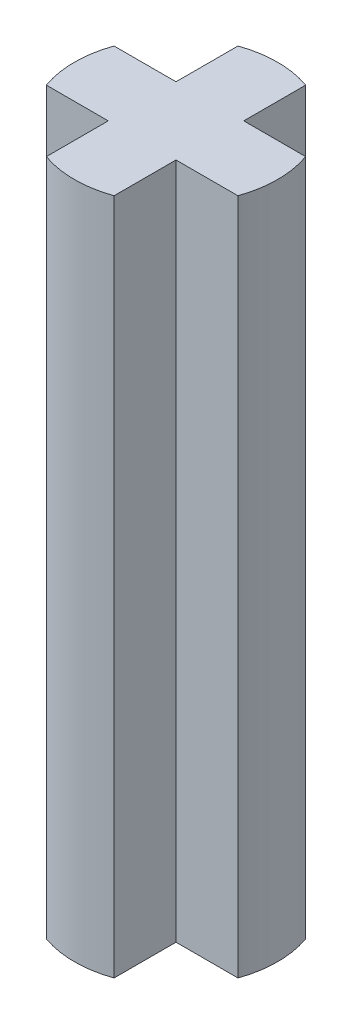
ISO-10303-21;
HEADER;
FILE_DESCRIPTION(('STEP AP214'),'2;1');
FILE_NAME('part.step','',(''),(''),'','','');
FILE_SCHEMA(('AUTOMOTIVE_DESIGN { 1 0 10303 214 1 1 1 1 }'));
ENDSEC;
DATA;
#1=APPLICATION_CONTEXT('core data for automotive mechanical design processes');
#2=APPLICATION_PROTOCOL_DEFINITION('international standard','automotive_design',2000,#1);
#3=PRODUCT_CONTEXT('',#1,'mechanical');
#4=PRODUCT('Part','Part','',(#3));
#5=PRODUCT_RELATED_PRODUCT_CATEGORY('part','',(#4));
#6=PRODUCT_DEFINITION_FORMATION('','',#4);
#7=PRODUCT_DEFINITION_CONTEXT('part definition',#1,'design');
#8=PRODUCT_DEFINITION('design','',#6,#7);
#9=PRODUCT_DEFINITION_SHAPE('','',#8);
#10=(LENGTH_UNIT() NAMED_UNIT(*) SI_UNIT(.MILLI.,.METRE.));
#11=(NAMED_UNIT(*) PLANE_ANGLE_UNIT() SI_UNIT($,.RADIAN.));
#12=(NAMED_UNIT(*) SI_UNIT($,.STERADIAN.) SOLID_ANGLE_UNIT());
#13=UNCERTAINTY_MEASURE_WITH_UNIT(LENGTH_MEASURE(1.E-05),#10,'distance_accuracy_value','');
#14=(GEOMETRIC_REPRESENTATION_CONTEXT(3) GLOBAL_UNCERTAINTY_ASSIGNED_CONTEXT((#13)) GLOBAL_UNIT_ASSIGNED_CONTEXT((#10,
#11,#12)) REPRESENTATION_CONTEXT('',''));
#15=CARTESIAN_POINT('',(0.,0.,0.));
#16=DIRECTION('',(0.,0.,1.));
#17=DIRECTION('',(1.,0.,0.));
#18=AXIS2_PLACEMENT_3D('',#15,#16,#17);
#19=CARTESIAN_POINT('',(-1.5,10.,0.5));
#20=DIRECTION('',(0.,0.,-1.));
#21=DIRECTION('',(-1.,0.,0.));
#22=AXIS2_PLACEMENT_3D('',#19,#20,#21);
#23=PLANE('',#22);
#24=DIRECTION('',(0.,1.,0.));
#25=VECTOR('',#24,1.);
#26=CARTESIAN_POINT('',(-1.4142135623731,-0.000999999999999265,0.5));
#27=LINE('',#26,#25);
#28=CARTESIAN_POINT('',(-1.4142135623731,10.,0.5));
#29=VERTEX_POINT('',#28);
#30=CARTESIAN_POINT('',(-1.4142135623731,0.,0.5));
#31=VERTEX_POINT('',#30);
#32=EDGE_CURVE('E243',#29,#31,#27,.F.);
#33=ORIENTED_EDGE('',*,*,#32,.T.);
#34=DIRECTION('',(1.,0.,0.));
#35=VECTOR('',#34,1.);
#36=CARTESIAN_POINT('',(-1.5,0.,0.5));
#37=LINE('',#36,#35);
#38=CARTESIAN_POINT('',(-0.5,0.,0.5));
#39=VERTEX_POINT('',#38);
#40=EDGE_CURVE('E211',#31,#39,#37,.T.);
#41=ORIENTED_EDGE('',*,*,#40,.T.);
#42=DIRECTION('',(0.,1.,0.));
#43=VECTOR('',#42,1.);
#44=CARTESIAN_POINT('',(-0.5,10.,0.5));
#45=LINE('',#44,#43);
#46=CARTESIAN_POINT('',(-0.5,10.,0.5));
#47=VERTEX_POINT('',#46);
#48=EDGE_CURVE('E65',#39,#47,#45,.T.);
#49=ORIENTED_EDGE('',*,*,#48,.T.);
#50=DIRECTION('',(1.,0.,0.));
#51=VECTOR('',#50,1.);
#52=CARTESIAN_POINT('',(-1.5,10.,0.5));
#53=LINE('',#52,#51);
#54=EDGE_CURVE('E206',#29,#47,#53,.T.);
#55=ORIENTED_EDGE('',*,*,#54,.F.);
#56=EDGE_LOOP('',(#33,#41,#49,#55));
#57=FACE_BOUND('',#56,.T.);
#58=ADVANCED_FACE('F57',(#57),#23,.F.);
#59=CARTESIAN_POINT('',(-1.5,10.,-0.5));
#60=DIRECTION('',(0.,0.,-1.));
#61=DIRECTION('',(-1.,0.,0.));
#62=AXIS2_PLACEMENT_3D('',#59,#60,#61);
#63=PLANE('',#62);
#64=DIRECTION('',(1.,0.,0.));
#65=VECTOR('',#64,1.);
#66=CARTESIAN_POINT('',(-1.5,0.,-0.5));
#67=LINE('',#66,#65);
#68=CARTESIAN_POINT('',(-1.4142135623731,0.,-0.5));
#69=VERTEX_POINT('',#68);
#70=CARTESIAN_POINT('',(-0.5,0.,-0.5));
#71=VERTEX_POINT('',#70);
#72=EDGE_CURVE('E214',#69,#71,#67,.T.);
#73=ORIENTED_EDGE('',*,*,#72,.F.);
#74=DIRECTION('',(0.,1.,0.));
#75=VECTOR('',#74,1.);
#76=CARTESIAN_POINT('',(-1.4142135623731,-0.000999999999999265,-0.5));
#77=LINE('',#76,#75);
#78=CARTESIAN_POINT('',(-1.4142135623731,10.,-0.5));
#79=VERTEX_POINT('',#78);
#80=EDGE_CURVE('E240',#79,#69,#77,.F.);
#81=ORIENTED_EDGE('',*,*,#80,.F.);
#82=DIRECTION('',(1.,0.,0.));
#83=VECTOR('',#82,1.);
#84=CARTESIAN_POINT('',(-1.5,10.,-0.5));
#85=LINE('',#84,#83);
#86=CARTESIAN_POINT('',(-0.5,10.,-0.5));
#87=VERTEX_POINT('',#86);
#88=EDGE_CURVE('E187',#79,#87,#85,.T.);
#89=ORIENTED_EDGE('',*,*,#88,.T.);
#90=DIRECTION('',(0.,1.,0.));
#91=VECTOR('',#90,1.);
#92=CARTESIAN_POINT('',(-0.5,10.,-0.5));
#93=LINE('',#92,#91);
#94=EDGE_CURVE('E183',#71,#87,#93,.T.);
#95=ORIENTED_EDGE('',*,*,#94,.F.);
#96=EDGE_LOOP('',(#73,#81,#89,#95));
#97=FACE_BOUND('',#96,.T.);
#98=ADVANCED_FACE('F259',(#97),#63,.T.);
#99=CARTESIAN_POINT('',(0.,0.,0.));
#100=DIRECTION('',(0.,1.,0.));
#101=DIRECTION('',(0.,0.,1.));
#102=AXIS2_PLACEMENT_3D('',#99,#100,#101);
#103=PLANE('',#102);
#104=CARTESIAN_POINT('',(0.,0.,0.));
#105=DIRECTION('',(0.,1.,0.));
#106=DIRECTION('',(0.,0.,1.));
#107=AXIS2_PLACEMENT_3D('',#104,#105,#106);
#108=CIRCLE('',#107,1.5);
#109=EDGE_CURVE('E162',#31,#69,#108,.F.);
#110=ORIENTED_EDGE('',*,*,#109,.T.);
#111=ORIENTED_EDGE('',*,*,#72,.T.);
#112=DIRECTION('',(0.,0.,-1.));
#113=VECTOR('',#112,1.);
#114=CARTESIAN_POINT('',(-0.5,0.,1.5));
#115=LINE('',#114,#113);
#116=CARTESIAN_POINT('',(-0.5,0.,-1.4142135623731));
#117=VERTEX_POINT('',#116);
#118=EDGE_CURVE('E174',#71,#117,#115,.T.);
#119=ORIENTED_EDGE('',*,*,#118,.T.);
#120=CARTESIAN_POINT('',(0.5,0.,-1.4142135623731));
#121=VERTEX_POINT('',#120);
#122=EDGE_CURVE('E159',#117,#121,#108,.F.);
#123=ORIENTED_EDGE('',*,*,#122,.T.);
#124=DIRECTION('',(0.,0.,-1.));
#125=VECTOR('',#124,1.);
#126=CARTESIAN_POINT('',(0.5,0.,1.5));
#127=LINE('',#126,#125);
#128=CARTESIAN_POINT('',(0.5,0.,-0.5));
#129=VERTEX_POINT('',#128);
#130=EDGE_CURVE('E253',#129,#121,#127,.T.);
#131=ORIENTED_EDGE('',*,*,#130,.F.);
#132=CARTESIAN_POINT('',(1.41421356237309,0.,-0.5));
#133=VERTEX_POINT('',#132);
#134=EDGE_CURVE('E196',#129,#133,#67,.T.);
#135=ORIENTED_EDGE('',*,*,#134,.T.);
#136=CARTESIAN_POINT('',(1.41421356237309,0.,0.5));
#137=VERTEX_POINT('',#136);
#138=EDGE_CURVE('E80',#133,#137,#108,.F.);
#139=ORIENTED_EDGE('',*,*,#138,.T.);
#140=CARTESIAN_POINT('',(0.5,0.,0.5));
#141=VERTEX_POINT('',#140);
#142=EDGE_CURVE('E213',#141,#137,#37,.T.);
#143=ORIENTED_EDGE('',*,*,#142,.F.);
#144=CARTESIAN_POINT('',(0.5,0.,1.4142135623731));
#145=VERTEX_POINT('',#144);
#146=EDGE_CURVE('E155',#145,#141,#127,.T.);
#147=ORIENTED_EDGE('',*,*,#146,.F.);
#148=CARTESIAN_POINT('',(-0.5,0.,1.4142135623731));
#149=VERTEX_POINT('',#148);
#150=EDGE_CURVE('E147',#145,#149,#108,.F.);
#151=ORIENTED_EDGE('',*,*,#150,.T.);
#152=EDGE_CURVE('E152',#149,#39,#115,.T.);
#153=ORIENTED_EDGE('',*,*,#152,.T.);
#154=ORIENTED_EDGE('',*,*,#40,.F.);
#155=EDGE_LOOP('',(#110,#111,#119,#123,#131,#135,#139,#143,#147,#151,#153,#154));
#156=FACE_BOUND('',#155,.T.);
#157=ADVANCED_FACE('F149',(#156),#103,.F.);
#158=CARTESIAN_POINT('',(0.,10.,0.));
#159=DIRECTION('',(0.,1.,0.));
#160=DIRECTION('',(0.,0.,1.));
#161=AXIS2_PLACEMENT_3D('',#158,#159,#160);
#162=PLANE('',#161);
#163=ORIENTED_EDGE('',*,*,#88,.F.);
#164=CARTESIAN_POINT('',(0.,10.,0.));
#165=DIRECTION('',(0.,1.,0.));
#166=DIRECTION('',(0.,0.,1.));
#167=AXIS2_PLACEMENT_3D('',#164,#165,#166);
#168=CIRCLE('',#167,1.5);
#169=EDGE_CURVE('E72',#79,#29,#168,.T.);
#170=ORIENTED_EDGE('',*,*,#169,.T.);
#171=ORIENTED_EDGE('',*,*,#54,.T.);
#172=DIRECTION('',(0.,0.,-1.));
#173=VECTOR('',#172,1.);
#174=CARTESIAN_POINT('',(-0.5,10.,1.5));
#175=LINE('',#174,#173);
#176=CARTESIAN_POINT('',(-0.5,10.,1.4142135623731));
#177=VERTEX_POINT('',#176);
#178=EDGE_CURVE('E216',#177,#47,#175,.T.);
#179=ORIENTED_EDGE('',*,*,#178,.F.);
#180=CARTESIAN_POINT('',(0.5,10.,1.4142135623731));
#181=VERTEX_POINT('',#180);
#182=EDGE_CURVE('E160',#177,#181,#168,.T.);
#183=ORIENTED_EDGE('',*,*,#182,.T.);
#184=DIRECTION('',(0.,0.,-1.));
#185=VECTOR('',#184,1.);
#186=CARTESIAN_POINT('',(0.5,10.,1.5));
#187=LINE('',#186,#185);
#188=CARTESIAN_POINT('',(0.5,10.,0.5));
#189=VERTEX_POINT('',#188);
#190=EDGE_CURVE('E177',#181,#189,#187,.T.);
#191=ORIENTED_EDGE('',*,*,#190,.T.);
#192=CARTESIAN_POINT('',(1.41421356237309,10.,0.5));
#193=VERTEX_POINT('',#192);
#194=EDGE_CURVE('E208',#189,#193,#53,.T.);
#195=ORIENTED_EDGE('',*,*,#194,.T.);
#196=CARTESIAN_POINT('',(1.41421356237309,10.,-0.5));
#197=VERTEX_POINT('',#196);
#198=EDGE_CURVE('E205',#193,#197,#168,.T.);
#199=ORIENTED_EDGE('',*,*,#198,.T.);
#200=CARTESIAN_POINT('',(0.5,10.,-0.5));
#201=VERTEX_POINT('',#200);
#202=EDGE_CURVE('E194',#201,#197,#85,.T.);
#203=ORIENTED_EDGE('',*,*,#202,.F.);
#204=CARTESIAN_POINT('',(0.5,10.,-1.4142135623731));
#205=VERTEX_POINT('',#204);
#206=EDGE_CURVE('E173',#201,#205,#187,.T.);
#207=ORIENTED_EDGE('',*,*,#206,.T.);
#208=CARTESIAN_POINT('',(-0.5,10.,-1.4142135623731));
#209=VERTEX_POINT('',#208);
#210=EDGE_CURVE('E227',#205,#209,#168,.T.);
#211=ORIENTED_EDGE('',*,*,#210,.T.);
#212=EDGE_CURVE('E215',#87,#209,#175,.T.);
#213=ORIENTED_EDGE('',*,*,#212,.F.);
#214=EDGE_LOOP('',(#163,#170,#171,#179,#183,#191,#195,#199,#203,#207,#211,#213));
#215=FACE_BOUND('',#214,.T.);
#216=ADVANCED_FACE('F203',(#215),#162,.T.);
#217=DIRECTION('',(0.,1.,0.));
#218=VECTOR('',#217,1.);
#219=CARTESIAN_POINT('',(1.4142135623731,-0.000999999999999265,0.5));
#220=LINE('',#219,#218);
#221=EDGE_CURVE('E237',#137,#193,#220,.T.);
#222=ORIENTED_EDGE('',*,*,#221,.T.);
#223=ORIENTED_EDGE('',*,*,#194,.F.);
#224=DIRECTION('',(0.,1.,0.));
#225=VECTOR('',#224,1.);
#226=CARTESIAN_POINT('',(0.5,10.,0.5));
#227=LINE('',#226,#225);
#228=EDGE_CURVE('E12',#141,#189,#227,.T.);
#229=ORIENTED_EDGE('',*,*,#228,.F.);
#230=ORIENTED_EDGE('',*,*,#142,.T.);
#231=EDGE_LOOP('',(#222,#223,#229,#230));
#232=FACE_BOUND('',#231,.T.);
#233=ADVANCED_FACE('F251',(#232),#23,.F.);
#234=ORIENTED_EDGE('',*,*,#202,.T.);
#235=DIRECTION('',(0.,1.,0.));
#236=VECTOR('',#235,1.);
#237=CARTESIAN_POINT('',(1.4142135623731,-0.000999999999999265,-0.5));
#238=LINE('',#237,#236);
#239=EDGE_CURVE('E232',#133,#197,#238,.T.);
#240=ORIENTED_EDGE('',*,*,#239,.F.);
#241=ORIENTED_EDGE('',*,*,#134,.F.);
#242=DIRECTION('',(0.,1.,0.));
#243=VECTOR('',#242,1.);
#244=CARTESIAN_POINT('',(0.5,10.,-0.5));
#245=LINE('',#244,#243);
#246=EDGE_CURVE('E186',#129,#201,#245,.T.);
#247=ORIENTED_EDGE('',*,*,#246,.T.);
#248=EDGE_LOOP('',(#234,#240,#241,#247));
#249=FACE_BOUND('',#248,.T.);
#250=ADVANCED_FACE('F192',(#249),#63,.T.);
#251=CARTESIAN_POINT('',(0.5,10.,1.5));
#252=DIRECTION('',(-1.,0.,0.));
#253=DIRECTION('',(0.,0.,1.));
#254=AXIS2_PLACEMENT_3D('',#251,#252,#253);
#255=PLANE('',#254);
#256=DIRECTION('',(0.,1.,0.));
#257=VECTOR('',#256,1.);
#258=CARTESIAN_POINT('',(0.5,-0.000999999999999265,-1.4142135623731));
#259=LINE('',#258,#257);
#260=EDGE_CURVE('E202',#121,#205,#259,.T.);
#261=ORIENTED_EDGE('',*,*,#260,.T.);
#262=ORIENTED_EDGE('',*,*,#206,.F.);
#263=ORIENTED_EDGE('',*,*,#246,.F.);
#264=ORIENTED_EDGE('',*,*,#130,.T.);
#265=EDGE_LOOP('',(#261,#262,#263,#264));
#266=FACE_BOUND('',#265,.T.);
#267=ADVANCED_FACE('F59',(#266),#255,.F.);
#268=CARTESIAN_POINT('',(-0.5,10.,1.5));
#269=DIRECTION('',(-1.,0.,0.));
#270=DIRECTION('',(0.,0.,1.));
#271=AXIS2_PLACEMENT_3D('',#268,#269,#270);
#272=PLANE('',#271);
#273=ORIENTED_EDGE('',*,*,#212,.T.);
#274=DIRECTION('',(0.,1.,0.));
#275=VECTOR('',#274,1.);
#276=CARTESIAN_POINT('',(-0.5,-0.000999999999999265,-1.4142135623731));
#277=LINE('',#276,#275);
#278=EDGE_CURVE('E225',#117,#209,#277,.T.);
#279=ORIENTED_EDGE('',*,*,#278,.F.);
#280=ORIENTED_EDGE('',*,*,#118,.F.);
#281=ORIENTED_EDGE('',*,*,#94,.T.);
#282=EDGE_LOOP('',(#273,#279,#280,#281));
#283=FACE_BOUND('',#282,.T.);
#284=ADVANCED_FACE('F222',(#283),#272,.T.);
#285=DIRECTION('',(0.,1.,0.));
#286=VECTOR('',#285,1.);
#287=CARTESIAN_POINT('',(0.5,-0.000999999999999265,1.4142135623731));
#288=LINE('',#287,#286);
#289=EDGE_CURVE('E169',#181,#145,#288,.F.);
#290=ORIENTED_EDGE('',*,*,#289,.T.);
#291=ORIENTED_EDGE('',*,*,#146,.T.);
#292=ORIENTED_EDGE('',*,*,#228,.T.);
#293=ORIENTED_EDGE('',*,*,#190,.F.);
#294=EDGE_LOOP('',(#290,#291,#292,#293));
#295=FACE_BOUND('',#294,.T.);
#296=ADVANCED_FACE('F247',(#295),#255,.F.);
#297=ORIENTED_EDGE('',*,*,#152,.F.);
#298=DIRECTION('',(0.,1.,0.));
#299=VECTOR('',#298,1.);
#300=CARTESIAN_POINT('',(-0.5,-0.000999999999999265,1.4142135623731));
#301=LINE('',#300,#299);
#302=EDGE_CURVE('E164',#177,#149,#301,.F.);
#303=ORIENTED_EDGE('',*,*,#302,.F.);
#304=ORIENTED_EDGE('',*,*,#178,.T.);
#305=ORIENTED_EDGE('',*,*,#48,.F.);
#306=EDGE_LOOP('',(#297,#303,#304,#305));
#307=FACE_BOUND('',#306,.T.);
#308=ADVANCED_FACE('F171',(#307),#272,.T.);
#309=CARTESIAN_POINT('',(0.,-0.000999999999999265,0.));
#310=DIRECTION('',(0.,1.,0.));
#311=DIRECTION('',(0.,0.,1.));
#312=AXIS2_PLACEMENT_3D('',#309,#310,#311);
#313=CYLINDRICAL_SURFACE('',#312,1.5);
#314=ORIENTED_EDGE('',*,*,#302,.T.);
#315=ORIENTED_EDGE('',*,*,#150,.F.);
#316=ORIENTED_EDGE('',*,*,#289,.F.);
#317=ORIENTED_EDGE('',*,*,#182,.F.);
#318=EDGE_LOOP('',(#314,#315,#316,#317));
#319=FACE_BOUND('',#318,.T.);
#320=ADVANCED_FACE('F165',(#319),#313,.T.);
#321=ORIENTED_EDGE('',*,*,#260,.F.);
#322=ORIENTED_EDGE('',*,*,#122,.F.);
#323=ORIENTED_EDGE('',*,*,#278,.T.);
#324=ORIENTED_EDGE('',*,*,#210,.F.);
#325=EDGE_LOOP('',(#321,#322,#323,#324));
#326=FACE_BOUND('',#325,.T.);
#327=ADVANCED_FACE('F230',(#326),#313,.T.);
#328=ORIENTED_EDGE('',*,*,#221,.F.);
#329=ORIENTED_EDGE('',*,*,#138,.F.);
#330=ORIENTED_EDGE('',*,*,#239,.T.);
#331=ORIENTED_EDGE('',*,*,#198,.F.);
#332=EDGE_LOOP('',(#328,#329,#330,#331));
#333=FACE_BOUND('',#332,.T.);
#334=ADVANCED_FACE('F252',(#333),#313,.T.);
#335=ORIENTED_EDGE('',*,*,#80,.T.);
#336=ORIENTED_EDGE('',*,*,#109,.F.);
#337=ORIENTED_EDGE('',*,*,#32,.F.);
#338=ORIENTED_EDGE('',*,*,#169,.F.);
#339=EDGE_LOOP('',(#335,#336,#337,#338));
#340=FACE_BOUND('',#339,.T.);
#341=ADVANCED_FACE('F257',(#340),#313,.T.);
#342=CLOSED_SHELL('',(#58,#98,#157,#216,#233,#250,#267,#284,#296,#308,#320,#327,#334,#341));
#343=MANIFOLD_SOLID_BREP('B2',#342);
#344=ADVANCED_BREP_SHAPE_REPRESENTATION('',(#18,#343),#14);
#345=SHAPE_DEFINITION_REPRESENTATION(#9,#344);
ENDSEC;
END-ISO-10303-21;
